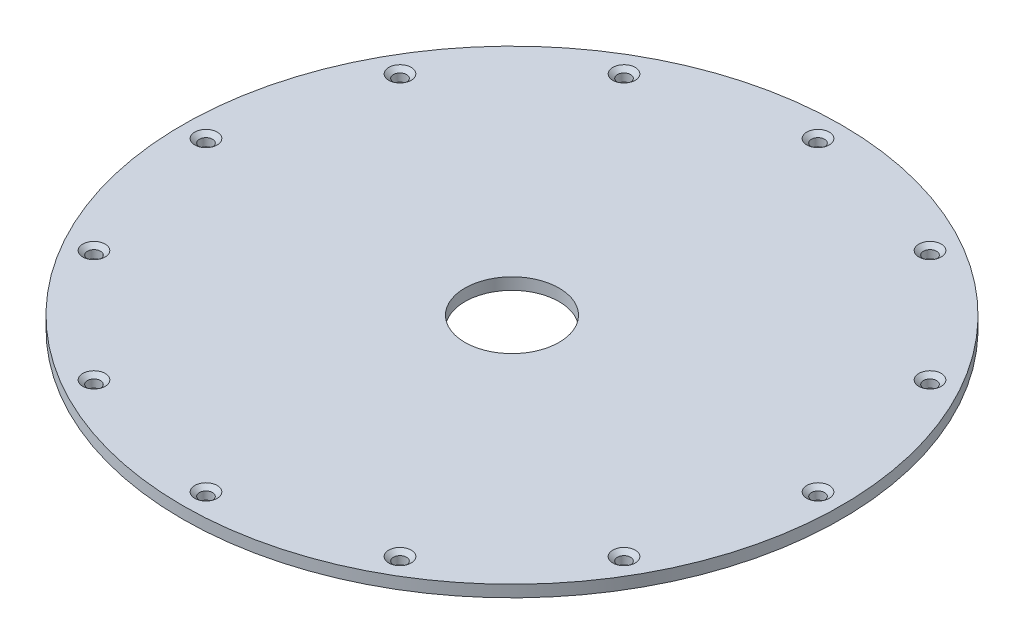
ISO-10303-21;
HEADER;
FILE_DESCRIPTION(('STEP AP214'),'2;1');
FILE_NAME('part.step','',(''),(''),'','','');
FILE_SCHEMA(('AUTOMOTIVE_DESIGN { 1 0 10303 214 1 1 1 1 }'));
ENDSEC;
DATA;
#1=APPLICATION_CONTEXT('core data for automotive mechanical design processes');
#2=APPLICATION_PROTOCOL_DEFINITION('international standard','automotive_design',2000,#1);
#3=PRODUCT_CONTEXT('',#1,'mechanical');
#4=PRODUCT('Part','Part','',(#3));
#5=PRODUCT_RELATED_PRODUCT_CATEGORY('part','',(#4));
#6=PRODUCT_DEFINITION_FORMATION('','',#4);
#7=PRODUCT_DEFINITION_CONTEXT('part definition',#1,'design');
#8=PRODUCT_DEFINITION('design','',#6,#7);
#9=PRODUCT_DEFINITION_SHAPE('','',#8);
#10=(LENGTH_UNIT() NAMED_UNIT(*) SI_UNIT(.MILLI.,.METRE.));
#11=(NAMED_UNIT(*) PLANE_ANGLE_UNIT() SI_UNIT($,.RADIAN.));
#12=(NAMED_UNIT(*) SI_UNIT($,.STERADIAN.) SOLID_ANGLE_UNIT());
#13=UNCERTAINTY_MEASURE_WITH_UNIT(LENGTH_MEASURE(1.E-05),#10,'distance_accuracy_value','');
#14=(GEOMETRIC_REPRESENTATION_CONTEXT(3) GLOBAL_UNCERTAINTY_ASSIGNED_CONTEXT((#13)) GLOBAL_UNIT_ASSIGNED_CONTEXT((#10,
#11,#12)) REPRESENTATION_CONTEXT('',''));
#15=CARTESIAN_POINT('',(0.,0.,0.));
#16=DIRECTION('',(0.,0.,1.));
#17=DIRECTION('',(1.,0.,0.));
#18=AXIS2_PLACEMENT_3D('',#15,#16,#17);
#19=CARTESIAN_POINT('',(0.,55.,0.));
#20=DIRECTION('',(0.,1.,0.));
#21=DIRECTION('',(0.,0.,1.));
#22=AXIS2_PLACEMENT_3D('',#19,#20,#21);
#23=CYLINDRICAL_SURFACE('',#22,44.45);
#24=CARTESIAN_POINT('',(0.,0.,0.));
#25=DIRECTION('',(0.,1.,0.));
#26=DIRECTION('',(0.,0.,1.));
#27=AXIS2_PLACEMENT_3D('',#24,#25,#26);
#28=CIRCLE('',#27,44.45);
#29=CARTESIAN_POINT('',(0.,0.,44.45));
#30=VERTEX_POINT('',#29);
#31=EDGE_CURVE('E45',#30,#30,#28,.T.);
#32=ORIENTED_EDGE('',*,*,#31,.T.);
#33=EDGE_LOOP('',(#32));
#34=FACE_BOUND('',#33,.T.);
#35=CARTESIAN_POINT('',(0.,1.5875,0.));
#36=DIRECTION('',(0.,1.,0.));
#37=DIRECTION('',(0.,0.,1.));
#38=AXIS2_PLACEMENT_3D('',#35,#36,#37);
#39=CIRCLE('',#38,44.45);
#40=CARTESIAN_POINT('',(0.,1.5875,44.45));
#41=VERTEX_POINT('',#40);
#42=EDGE_CURVE('E10',#41,#41,#39,.T.);
#43=ORIENTED_EDGE('',*,*,#42,.F.);
#44=EDGE_LOOP('',(#43));
#45=FACE_BOUND('',#44,.T.);
#46=ADVANCED_FACE('F31',(#34,#45),#23,.T.);
#47=CARTESIAN_POINT('',(-44.45,1.5875,0.));
#48=DIRECTION('',(0.,1.,0.));
#49=DIRECTION('',(0.,0.,1.));
#50=AXIS2_PLACEMENT_3D('',#47,#48,#49);
#51=PLANE('',#50);
#52=CARTESIAN_POINT('',(-35.7451985412029,1.5875,20.6374999999996));
#53=DIRECTION('',(0.,1.,0.));
#54=DIRECTION('',(0.,0.,1.));
#55=AXIS2_PLACEMENT_3D('',#52,#53,#54);
#56=CIRCLE('',#55,1.5113);
#57=CARTESIAN_POINT('',(-35.7451985412029,1.5875,22.1487999999996));
#58=VERTEX_POINT('',#57);
#59=EDGE_CURVE('E155',#58,#58,#56,.T.);
#60=ORIENTED_EDGE('',*,*,#59,.F.);
#61=EDGE_LOOP('',(#60));
#62=FACE_BOUND('',#61,.T.);
#63=CARTESIAN_POINT('',(-20.6375000000004,1.5875,35.7451985412025));
#64=DIRECTION('',(0.,1.,0.));
#65=DIRECTION('',(0.,0.,1.));
#66=AXIS2_PLACEMENT_3D('',#63,#64,#65);
#67=CIRCLE('',#66,1.5113);
#68=CARTESIAN_POINT('',(-20.6375000000004,1.5875,37.2564985412025));
#69=VERTEX_POINT('',#68);
#70=EDGE_CURVE('E146',#69,#69,#67,.T.);
#71=ORIENTED_EDGE('',*,*,#70,.F.);
#72=EDGE_LOOP('',(#71));
#73=FACE_BOUND('',#72,.T.);
#74=CARTESIAN_POINT('',(-3.53958818572525E-13,1.5875,41.275));
#75=DIRECTION('',(0.,1.,0.));
#76=DIRECTION('',(0.,0.,1.));
#77=AXIS2_PLACEMENT_3D('',#74,#75,#76);
#78=CIRCLE('',#77,1.5113);
#79=CARTESIAN_POINT('',(-3.53958818572525E-13,1.5875,42.7863));
#80=VERTEX_POINT('',#79);
#81=EDGE_CURVE('E137',#80,#80,#78,.T.);
#82=ORIENTED_EDGE('',*,*,#81,.F.);
#83=EDGE_LOOP('',(#82));
#84=FACE_BOUND('',#83,.T.);
#85=CARTESIAN_POINT('',(20.6374999999997,1.5875,35.7451985412029));
#86=DIRECTION('',(0.,1.,0.));
#87=DIRECTION('',(0.,0.,1.));
#88=AXIS2_PLACEMENT_3D('',#85,#86,#87);
#89=CIRCLE('',#88,1.5113);
#90=CARTESIAN_POINT('',(20.6374999999997,1.5875,37.2564985412029));
#91=VERTEX_POINT('',#90);
#92=EDGE_CURVE('E128',#91,#91,#89,.T.);
#93=ORIENTED_EDGE('',*,*,#92,.F.);
#94=EDGE_LOOP('',(#93));
#95=FACE_BOUND('',#94,.T.);
#96=CARTESIAN_POINT('',(35.7451985412026,1.5875,20.6375000000002));
#97=DIRECTION('',(0.,1.,0.));
#98=DIRECTION('',(0.,0.,1.));
#99=AXIS2_PLACEMENT_3D('',#96,#97,#98);
#100=CIRCLE('',#99,1.5113);
#101=CARTESIAN_POINT('',(35.7451985412026,1.5875,22.1488000000002));
#102=VERTEX_POINT('',#101);
#103=EDGE_CURVE('E119',#102,#102,#100,.T.);
#104=ORIENTED_EDGE('',*,*,#103,.F.);
#105=EDGE_LOOP('',(#104));
#106=FACE_BOUND('',#105,.T.);
#107=CARTESIAN_POINT('',(41.275,1.5875,2.28177708448336E-13));
#108=DIRECTION('',(0.,1.,0.));
#109=DIRECTION('',(0.,0.,1.));
#110=AXIS2_PLACEMENT_3D('',#107,#108,#109);
#111=CIRCLE('',#110,1.5113);
#112=CARTESIAN_POINT('',(41.275,1.5875,1.51130000000023));
#113=VERTEX_POINT('',#112);
#114=EDGE_CURVE('E110',#113,#113,#111,.T.);
#115=ORIENTED_EDGE('',*,*,#114,.F.);
#116=EDGE_LOOP('',(#115));
#117=FACE_BOUND('',#116,.T.);
#118=CARTESIAN_POINT('',(35.7451985412028,1.5875,-20.6374999999998));
#119=DIRECTION('',(0.,1.,0.));
#120=DIRECTION('',(0.,0.,1.));
#121=AXIS2_PLACEMENT_3D('',#118,#119,#120);
#122=CIRCLE('',#121,1.5113);
#123=CARTESIAN_POINT('',(35.7451985412028,1.5875,-19.1261999999998));
#124=VERTEX_POINT('',#123);
#125=EDGE_CURVE('E101',#124,#124,#122,.T.);
#126=ORIENTED_EDGE('',*,*,#125,.F.);
#127=EDGE_LOOP('',(#126));
#128=FACE_BOUND('',#127,.T.);
#129=CARTESIAN_POINT('',(20.6375000000001,1.5875,-35.7451985412026));
#130=DIRECTION('',(0.,1.,0.));
#131=DIRECTION('',(0.,0.,1.));
#132=AXIS2_PLACEMENT_3D('',#129,#130,#131);
#133=CIRCLE('',#132,1.5113);
#134=CARTESIAN_POINT('',(20.6375000000001,1.5875,-34.2338985412026));
#135=VERTEX_POINT('',#134);
#136=EDGE_CURVE('E92',#135,#135,#133,.T.);
#137=ORIENTED_EDGE('',*,*,#136,.F.);
#138=EDGE_LOOP('',(#137));
#139=FACE_BOUND('',#138,.T.);
#140=CARTESIAN_POINT('',(1.11561489392428E-13,1.5875,-41.275));
#141=DIRECTION('',(0.,1.,0.));
#142=DIRECTION('',(0.,0.,1.));
#143=AXIS2_PLACEMENT_3D('',#140,#141,#142);
#144=CIRCLE('',#143,1.5113);
#145=CARTESIAN_POINT('',(1.11561489392428E-13,1.5875,-39.7637));
#146=VERTEX_POINT('',#145);
#147=EDGE_CURVE('E83',#146,#146,#144,.T.);
#148=ORIENTED_EDGE('',*,*,#147,.F.);
#149=EDGE_LOOP('',(#148));
#150=FACE_BOUND('',#149,.T.);
#151=CARTESIAN_POINT('',(-20.6374999999999,1.5875,-35.7451985412027));
#152=DIRECTION('',(0.,1.,0.));
#153=DIRECTION('',(0.,0.,1.));
#154=AXIS2_PLACEMENT_3D('',#151,#152,#153);
#155=CIRCLE('',#154,1.5113);
#156=CARTESIAN_POINT('',(-20.6374999999999,1.5875,-34.2338985412027));
#157=VERTEX_POINT('',#156);
#158=EDGE_CURVE('E74',#157,#157,#155,.T.);
#159=ORIENTED_EDGE('',*,*,#158,.F.);
#160=EDGE_LOOP('',(#159));
#161=FACE_BOUND('',#160,.T.);
#162=CARTESIAN_POINT('',(-35.7451985412027,1.5875,-20.6375));
#163=DIRECTION('',(0.,1.,0.));
#164=DIRECTION('',(0.,0.,1.));
#165=AXIS2_PLACEMENT_3D('',#162,#163,#164);
#166=CIRCLE('',#165,1.5113);
#167=CARTESIAN_POINT('',(-35.7451985412027,1.5875,-19.1262));
#168=VERTEX_POINT('',#167);
#169=EDGE_CURVE('E65',#168,#168,#166,.T.);
#170=ORIENTED_EDGE('',*,*,#169,.F.);
#171=EDGE_LOOP('',(#170));
#172=FACE_BOUND('',#171,.T.);
#173=CARTESIAN_POINT('',(-41.275,1.5875,0.));
#174=DIRECTION('',(0.,1.,0.));
#175=DIRECTION('',(0.,0.,1.));
#176=AXIS2_PLACEMENT_3D('',#173,#174,#175);
#177=CIRCLE('',#176,1.5113);
#178=CARTESIAN_POINT('',(-41.275,1.5875,1.51130000000001));
#179=VERTEX_POINT('',#178);
#180=EDGE_CURVE('E56',#179,#179,#177,.T.);
#181=ORIENTED_EDGE('',*,*,#180,.F.);
#182=EDGE_LOOP('',(#181));
#183=FACE_BOUND('',#182,.T.);
#184=ORIENTED_EDGE('',*,*,#42,.T.);
#185=EDGE_LOOP('',(#184));
#186=FACE_BOUND('',#185,.T.);
#187=CARTESIAN_POINT('',(0.,1.5875,0.));
#188=DIRECTION('',(0.,1.,0.));
#189=DIRECTION('',(0.,0.,1.));
#190=AXIS2_PLACEMENT_3D('',#187,#188,#189);
#191=CIRCLE('',#190,6.35);
#192=CARTESIAN_POINT('',(0.,1.5875,6.35));
#193=VERTEX_POINT('',#192);
#194=EDGE_CURVE('E37',#193,#193,#191,.T.);
#195=ORIENTED_EDGE('',*,*,#194,.F.);
#196=EDGE_LOOP('',(#195));
#197=FACE_BOUND('',#196,.T.);
#198=ADVANCED_FACE('F161',(#62,#73,#84,#95,#106,#117,#128,#139,#150,#161,#172,#183,#186,#197),
#51,.T.);
#199=CARTESIAN_POINT('',(0.,55.,0.));
#200=DIRECTION('',(0.,1.,0.));
#201=DIRECTION('',(0.,0.,1.));
#202=AXIS2_PLACEMENT_3D('',#199,#200,#201);
#203=CYLINDRICAL_SURFACE('',#202,6.35);
#204=ORIENTED_EDGE('',*,*,#194,.T.);
#205=EDGE_LOOP('',(#204));
#206=FACE_BOUND('',#205,.T.);
#207=CARTESIAN_POINT('',(0.,0.,0.));
#208=DIRECTION('',(0.,1.,0.));
#209=DIRECTION('',(0.,0.,1.));
#210=AXIS2_PLACEMENT_3D('',#207,#208,#209);
#211=CIRCLE('',#210,6.35);
#212=CARTESIAN_POINT('',(0.,0.,6.35));
#213=VERTEX_POINT('',#212);
#214=EDGE_CURVE('E41',#213,#213,#211,.T.);
#215=ORIENTED_EDGE('',*,*,#214,.F.);
#216=EDGE_LOOP('',(#215));
#217=FACE_BOUND('',#216,.T.);
#218=ADVANCED_FACE('F164',(#206,#217),#203,.F.);
#219=CARTESIAN_POINT('',(-44.45,0.,0.));
#220=DIRECTION('',(0.,-1.,0.));
#221=DIRECTION('',(0.,0.,-1.));
#222=AXIS2_PLACEMENT_3D('',#219,#220,#221);
#223=PLANE('',#222);
#224=CARTESIAN_POINT('',(-35.7451985412029,0.,20.6374999999996));
#225=DIRECTION('',(0.,1.,0.));
#226=DIRECTION('',(0.,0.,1.));
#227=AXIS2_PLACEMENT_3D('',#224,#225,#226);
#228=CIRCLE('',#227,0.889000000000001);
#229=CARTESIAN_POINT('',(-35.7451985412029,0.,21.5264999999996));
#230=VERTEX_POINT('',#229);
#231=EDGE_CURVE('E149',#230,#230,#228,.T.);
#232=ORIENTED_EDGE('',*,*,#231,.T.);
#233=EDGE_LOOP('',(#232));
#234=FACE_BOUND('',#233,.T.);
#235=CARTESIAN_POINT('',(-20.6375000000004,0.,35.7451985412025));
#236=DIRECTION('',(0.,1.,0.));
#237=DIRECTION('',(0.,0.,1.));
#238=AXIS2_PLACEMENT_3D('',#235,#236,#237);
#239=CIRCLE('',#238,0.888999999999997);
#240=CARTESIAN_POINT('',(-20.6375000000004,0.,36.6341985412025));
#241=VERTEX_POINT('',#240);
#242=EDGE_CURVE('E140',#241,#241,#239,.T.);
#243=ORIENTED_EDGE('',*,*,#242,.T.);
#244=EDGE_LOOP('',(#243));
#245=FACE_BOUND('',#244,.T.);
#246=CARTESIAN_POINT('',(-3.53958818572525E-13,0.,41.275));
#247=DIRECTION('',(0.,1.,0.));
#248=DIRECTION('',(0.,0.,1.));
#249=AXIS2_PLACEMENT_3D('',#246,#247,#248);
#250=CIRCLE('',#249,0.888999999999999);
#251=CARTESIAN_POINT('',(-3.53958818572525E-13,0.,42.164));
#252=VERTEX_POINT('',#251);
#253=EDGE_CURVE('E131',#252,#252,#250,.T.);
#254=ORIENTED_EDGE('',*,*,#253,.T.);
#255=EDGE_LOOP('',(#254));
#256=FACE_BOUND('',#255,.T.);
#257=CARTESIAN_POINT('',(20.6374999999997,0.,35.7451985412029));
#258=DIRECTION('',(0.,1.,0.));
#259=DIRECTION('',(0.,0.,1.));
#260=AXIS2_PLACEMENT_3D('',#257,#258,#259);
#261=CIRCLE('',#260,0.888999999999997);
#262=CARTESIAN_POINT('',(20.6374999999997,0.,36.6341985412029));
#263=VERTEX_POINT('',#262);
#264=EDGE_CURVE('E122',#263,#263,#261,.T.);
#265=ORIENTED_EDGE('',*,*,#264,.T.);
#266=EDGE_LOOP('',(#265));
#267=FACE_BOUND('',#266,.T.);
#268=CARTESIAN_POINT('',(35.7451985412026,0.,20.6375000000002));
#269=DIRECTION('',(0.,1.,0.));
#270=DIRECTION('',(0.,0.,1.));
#271=AXIS2_PLACEMENT_3D('',#268,#269,#270);
#272=CIRCLE('',#271,0.889000000000001);
#273=CARTESIAN_POINT('',(35.7451985412026,0.,21.5265000000002));
#274=VERTEX_POINT('',#273);
#275=EDGE_CURVE('E113',#274,#274,#272,.T.);
#276=ORIENTED_EDGE('',*,*,#275,.T.);
#277=EDGE_LOOP('',(#276));
#278=FACE_BOUND('',#277,.T.);
#279=CARTESIAN_POINT('',(41.275,0.,2.28177708448336E-13));
#280=DIRECTION('',(0.,1.,0.));
#281=DIRECTION('',(0.,0.,1.));
#282=AXIS2_PLACEMENT_3D('',#279,#280,#281);
#283=CIRCLE('',#282,0.889000000000001);
#284=CARTESIAN_POINT('',(41.275,0.,0.889000000000229));
#285=VERTEX_POINT('',#284);
#286=EDGE_CURVE('E104',#285,#285,#283,.T.);
#287=ORIENTED_EDGE('',*,*,#286,.T.);
#288=EDGE_LOOP('',(#287));
#289=FACE_BOUND('',#288,.T.);
#290=CARTESIAN_POINT('',(35.7451985412028,0.,-20.6374999999998));
#291=DIRECTION('',(0.,1.,0.));
#292=DIRECTION('',(0.,0.,1.));
#293=AXIS2_PLACEMENT_3D('',#290,#291,#292);
#294=CIRCLE('',#293,0.889000000000001);
#295=CARTESIAN_POINT('',(35.7451985412028,0.,-19.7484999999998));
#296=VERTEX_POINT('',#295);
#297=EDGE_CURVE('E95',#296,#296,#294,.T.);
#298=ORIENTED_EDGE('',*,*,#297,.T.);
#299=EDGE_LOOP('',(#298));
#300=FACE_BOUND('',#299,.T.);
#301=CARTESIAN_POINT('',(20.6375000000001,0.,-35.7451985412026));
#302=DIRECTION('',(0.,1.,0.));
#303=DIRECTION('',(0.,0.,1.));
#304=AXIS2_PLACEMENT_3D('',#301,#302,#303);
#305=CIRCLE('',#304,0.888999999999997);
#306=CARTESIAN_POINT('',(20.6375000000001,0.,-34.8561985412026));
#307=VERTEX_POINT('',#306);
#308=EDGE_CURVE('E86',#307,#307,#305,.T.);
#309=ORIENTED_EDGE('',*,*,#308,.T.);
#310=EDGE_LOOP('',(#309));
#311=FACE_BOUND('',#310,.T.);
#312=CARTESIAN_POINT('',(1.11561489392428E-13,0.,-41.275));
#313=DIRECTION('',(0.,1.,0.));
#314=DIRECTION('',(0.,0.,1.));
#315=AXIS2_PLACEMENT_3D('',#312,#313,#314);
#316=CIRCLE('',#315,0.888999999999999);
#317=CARTESIAN_POINT('',(1.11561489392428E-13,0.,-40.386));
#318=VERTEX_POINT('',#317);
#319=EDGE_CURVE('E77',#318,#318,#316,.T.);
#320=ORIENTED_EDGE('',*,*,#319,.T.);
#321=EDGE_LOOP('',(#320));
#322=FACE_BOUND('',#321,.T.);
#323=CARTESIAN_POINT('',(-20.6374999999999,0.,-35.7451985412027));
#324=DIRECTION('',(0.,1.,0.));
#325=DIRECTION('',(0.,0.,1.));
#326=AXIS2_PLACEMENT_3D('',#323,#324,#325);
#327=CIRCLE('',#326,0.888999999999997);
#328=CARTESIAN_POINT('',(-20.6374999999999,0.,-34.8561985412027));
#329=VERTEX_POINT('',#328);
#330=EDGE_CURVE('E68',#329,#329,#327,.T.);
#331=ORIENTED_EDGE('',*,*,#330,.T.);
#332=EDGE_LOOP('',(#331));
#333=FACE_BOUND('',#332,.T.);
#334=CARTESIAN_POINT('',(-35.7451985412027,0.,-20.6375));
#335=DIRECTION('',(0.,1.,0.));
#336=DIRECTION('',(0.,0.,1.));
#337=AXIS2_PLACEMENT_3D('',#334,#335,#336);
#338=CIRCLE('',#337,0.889000000000001);
#339=CARTESIAN_POINT('',(-35.7451985412027,0.,-19.7485));
#340=VERTEX_POINT('',#339);
#341=EDGE_CURVE('E59',#340,#340,#338,.T.);
#342=ORIENTED_EDGE('',*,*,#341,.T.);
#343=EDGE_LOOP('',(#342));
#344=FACE_BOUND('',#343,.T.);
#345=CARTESIAN_POINT('',(-41.275,0.,0.));
#346=DIRECTION('',(0.,1.,0.));
#347=DIRECTION('',(0.,0.,1.));
#348=AXIS2_PLACEMENT_3D('',#345,#346,#347);
#349=CIRCLE('',#348,0.889000000000001);
#350=CARTESIAN_POINT('',(-41.275,0.,0.889000000000006));
#351=VERTEX_POINT('',#350);
#352=EDGE_CURVE('E50',#351,#351,#349,.T.);
#353=ORIENTED_EDGE('',*,*,#352,.T.);
#354=EDGE_LOOP('',(#353));
#355=FACE_BOUND('',#354,.T.);
#356=ORIENTED_EDGE('',*,*,#214,.T.);
#357=EDGE_LOOP('',(#356));
#358=FACE_BOUND('',#357,.T.);
#359=ORIENTED_EDGE('',*,*,#31,.F.);
#360=EDGE_LOOP('',(#359));
#361=FACE_BOUND('',#360,.T.);
#362=ADVANCED_FACE('F201',(#234,#245,#256,#267,#278,#289,#300,#311,#322,#333,#344,#355,#358,
#361),#223,.T.);
#363=CARTESIAN_POINT('',(-41.275,1.5875,0.));
#364=DIRECTION('',(0.,1.,0.));
#365=DIRECTION('',(0.,0.,1.));
#366=AXIS2_PLACEMENT_3D('',#363,#364,#365);
#367=CYLINDRICAL_SURFACE('',#366,0.889000000000001);
#368=ORIENTED_EDGE('',*,*,#352,.F.);
#369=EDGE_LOOP('',(#368));
#370=FACE_BOUND('',#369,.T.);
#371=CARTESIAN_POINT('',(-41.275,1.06532829951838,0.));
#372=DIRECTION('',(0.,1.,0.));
#373=DIRECTION('',(0.,0.,1.));
#374=AXIS2_PLACEMENT_3D('',#371,#372,#373);
#375=CIRCLE('',#374,0.889000000000001);
#376=CARTESIAN_POINT('',(-41.275,1.06532829951838,0.889000000000006));
#377=VERTEX_POINT('',#376);
#378=EDGE_CURVE('E53',#377,#377,#375,.T.);
#379=ORIENTED_EDGE('',*,*,#378,.T.);
#380=EDGE_LOOP('',(#379));
#381=FACE_BOUND('',#380,.T.);
#382=ADVANCED_FACE('F191',(#370,#381),#367,.F.);
#383=CARTESIAN_POINT('',(-41.275,1.5875,0.));
#384=DIRECTION('',(0.,1.,0.));
#385=DIRECTION('',(0.,0.,1.));
#386=AXIS2_PLACEMENT_3D('',#383,#384,#385);
#387=CONICAL_SURFACE('',#386,1.5113,0.872664625997162);
#388=ORIENTED_EDGE('',*,*,#378,.F.);
#389=EDGE_LOOP('',(#388));
#390=FACE_BOUND('',#389,.T.);
#391=ORIENTED_EDGE('',*,*,#180,.T.);
#392=EDGE_LOOP('',(#391));
#393=FACE_BOUND('',#392,.T.);
#394=ADVANCED_FACE('F188',(#390,#393),#387,.F.);
#395=CARTESIAN_POINT('',(-35.7451985412027,1.5875,-20.6375));
#396=DIRECTION('',(0.,1.,0.));
#397=DIRECTION('',(0.,0.,1.));
#398=AXIS2_PLACEMENT_3D('',#395,#396,#397);
#399=CYLINDRICAL_SURFACE('',#398,0.889000000000001);
#400=ORIENTED_EDGE('',*,*,#341,.F.);
#401=EDGE_LOOP('',(#400));
#402=FACE_BOUND('',#401,.T.);
#403=CARTESIAN_POINT('',(-35.7451985412027,1.06532829951838,-20.6375));
#404=DIRECTION('',(0.,1.,0.));
#405=DIRECTION('',(0.,0.,1.));
#406=AXIS2_PLACEMENT_3D('',#403,#404,#405);
#407=CIRCLE('',#406,0.889000000000001);
#408=CARTESIAN_POINT('',(-35.7451985412027,1.06532829951838,-19.7485));
#409=VERTEX_POINT('',#408);
#410=EDGE_CURVE('E62',#409,#409,#407,.T.);
#411=ORIENTED_EDGE('',*,*,#410,.T.);
#412=EDGE_LOOP('',(#411));
#413=FACE_BOUND('',#412,.T.);
#414=ADVANCED_FACE('F190',(#402,#413),#399,.F.);
#415=CARTESIAN_POINT('',(-35.7451985412027,1.5875,-20.6375));
#416=DIRECTION('',(0.,1.,0.));
#417=DIRECTION('',(0.,0.,1.));
#418=AXIS2_PLACEMENT_3D('',#415,#416,#417);
#419=CONICAL_SURFACE('',#418,1.5113,0.872664625997162);
#420=ORIENTED_EDGE('',*,*,#410,.F.);
#421=EDGE_LOOP('',(#420));
#422=FACE_BOUND('',#421,.T.);
#423=ORIENTED_EDGE('',*,*,#169,.T.);
#424=EDGE_LOOP('',(#423));
#425=FACE_BOUND('',#424,.T.);
#426=ADVANCED_FACE('F198',(#422,#425),#419,.F.);
#427=CARTESIAN_POINT('',(-20.6374999999999,1.5875,-35.7451985412027));
#428=DIRECTION('',(0.,1.,0.));
#429=DIRECTION('',(0.,0.,1.));
#430=AXIS2_PLACEMENT_3D('',#427,#428,#429);
#431=CYLINDRICAL_SURFACE('',#430,0.888999999999999);
#432=ORIENTED_EDGE('',*,*,#330,.F.);
#433=EDGE_LOOP('',(#432));
#434=FACE_BOUND('',#433,.T.);
#435=CARTESIAN_POINT('',(-20.6374999999999,1.06532829951838,-35.7451985412027));
#436=DIRECTION('',(0.,1.,0.));
#437=DIRECTION('',(0.,0.,1.));
#438=AXIS2_PLACEMENT_3D('',#435,#436,#437);
#439=CIRCLE('',#438,0.889000000000001);
#440=CARTESIAN_POINT('',(-20.6374999999999,1.06532829951838,-34.8561985412027));
#441=VERTEX_POINT('',#440);
#442=EDGE_CURVE('E71',#441,#441,#439,.T.);
#443=ORIENTED_EDGE('',*,*,#442,.T.);
#444=EDGE_LOOP('',(#443));
#445=FACE_BOUND('',#444,.T.);
#446=ADVANCED_FACE('F251',(#434,#445),#431,.F.);
#447=CARTESIAN_POINT('',(-20.6374999999999,1.5875,-35.7451985412027));
#448=DIRECTION('',(0.,1.,0.));
#449=DIRECTION('',(0.,0.,1.));
#450=AXIS2_PLACEMENT_3D('',#447,#448,#449);
#451=CONICAL_SURFACE('',#450,1.5113,0.872664625997162);
#452=ORIENTED_EDGE('',*,*,#442,.F.);
#453=EDGE_LOOP('',(#452));
#454=FACE_BOUND('',#453,.T.);
#455=ORIENTED_EDGE('',*,*,#158,.T.);
#456=EDGE_LOOP('',(#455));
#457=FACE_BOUND('',#456,.T.);
#458=ADVANCED_FACE('F256',(#454,#457),#451,.F.);
#459=CARTESIAN_POINT('',(1.11561489392428E-13,1.5875,-41.275));
#460=DIRECTION('',(0.,1.,0.));
#461=DIRECTION('',(0.,0.,1.));
#462=AXIS2_PLACEMENT_3D('',#459,#460,#461);
#463=CYLINDRICAL_SURFACE('',#462,0.888999999999999);
#464=ORIENTED_EDGE('',*,*,#319,.F.);
#465=EDGE_LOOP('',(#464));
#466=FACE_BOUND('',#465,.T.);
#467=CARTESIAN_POINT('',(1.11561489392428E-13,1.06532829951838,-41.275));
#468=DIRECTION('',(0.,1.,0.));
#469=DIRECTION('',(0.,0.,1.));
#470=AXIS2_PLACEMENT_3D('',#467,#468,#469);
#471=CIRCLE('',#470,0.888999999999999);
#472=CARTESIAN_POINT('',(1.11561489392428E-13,1.06532829951838,-40.386));
#473=VERTEX_POINT('',#472);
#474=EDGE_CURVE('E80',#473,#473,#471,.T.);
#475=ORIENTED_EDGE('',*,*,#474,.T.);
#476=EDGE_LOOP('',(#475));
#477=FACE_BOUND('',#476,.T.);
#478=ADVANCED_FACE('F262',(#466,#477),#463,.F.);
#479=CARTESIAN_POINT('',(1.11561489392428E-13,1.5875,-41.275));
#480=DIRECTION('',(0.,1.,0.));
#481=DIRECTION('',(0.,0.,1.));
#482=AXIS2_PLACEMENT_3D('',#479,#480,#481);
#483=CONICAL_SURFACE('',#482,1.5113,0.872664625997163);
#484=ORIENTED_EDGE('',*,*,#474,.F.);
#485=EDGE_LOOP('',(#484));
#486=FACE_BOUND('',#485,.T.);
#487=ORIENTED_EDGE('',*,*,#147,.T.);
#488=EDGE_LOOP('',(#487));
#489=FACE_BOUND('',#488,.T.);
#490=ADVANCED_FACE('F266',(#486,#489),#483,.F.);
#491=CARTESIAN_POINT('',(20.6375000000001,1.5875,-35.7451985412026));
#492=DIRECTION('',(0.,1.,0.));
#493=DIRECTION('',(0.,0.,1.));
#494=AXIS2_PLACEMENT_3D('',#491,#492,#493);
#495=CYLINDRICAL_SURFACE('',#494,0.888999999999999);
#496=ORIENTED_EDGE('',*,*,#308,.F.);
#497=EDGE_LOOP('',(#496));
#498=FACE_BOUND('',#497,.T.);
#499=CARTESIAN_POINT('',(20.6375000000001,1.06532829951838,-35.7451985412026));
#500=DIRECTION('',(0.,1.,0.));
#501=DIRECTION('',(0.,0.,1.));
#502=AXIS2_PLACEMENT_3D('',#499,#500,#501);
#503=CIRCLE('',#502,0.889000000000001);
#504=CARTESIAN_POINT('',(20.6375000000001,1.06532829951838,-34.8561985412026));
#505=VERTEX_POINT('',#504);
#506=EDGE_CURVE('E89',#505,#505,#503,.T.);
#507=ORIENTED_EDGE('',*,*,#506,.T.);
#508=EDGE_LOOP('',(#507));
#509=FACE_BOUND('',#508,.T.);
#510=ADVANCED_FACE('F270',(#498,#509),#495,.F.);
#511=CARTESIAN_POINT('',(20.6375000000001,1.5875,-35.7451985412026));
#512=DIRECTION('',(0.,1.,0.));
#513=DIRECTION('',(0.,0.,1.));
#514=AXIS2_PLACEMENT_3D('',#511,#512,#513);
#515=CONICAL_SURFACE('',#514,1.5113,0.872664625997162);
#516=ORIENTED_EDGE('',*,*,#506,.F.);
#517=EDGE_LOOP('',(#516));
#518=FACE_BOUND('',#517,.T.);
#519=ORIENTED_EDGE('',*,*,#136,.T.);
#520=EDGE_LOOP('',(#519));
#521=FACE_BOUND('',#520,.T.);
#522=ADVANCED_FACE('F274',(#518,#521),#515,.F.);
#523=CARTESIAN_POINT('',(35.7451985412028,1.5875,-20.6374999999998));
#524=DIRECTION('',(0.,1.,0.));
#525=DIRECTION('',(0.,0.,1.));
#526=AXIS2_PLACEMENT_3D('',#523,#524,#525);
#527=CYLINDRICAL_SURFACE('',#526,0.889000000000001);
#528=ORIENTED_EDGE('',*,*,#297,.F.);
#529=EDGE_LOOP('',(#528));
#530=FACE_BOUND('',#529,.T.);
#531=CARTESIAN_POINT('',(35.7451985412028,1.06532829951838,-20.6374999999998));
#532=DIRECTION('',(0.,1.,0.));
#533=DIRECTION('',(0.,0.,1.));
#534=AXIS2_PLACEMENT_3D('',#531,#532,#533);
#535=CIRCLE('',#534,0.889000000000001);
#536=CARTESIAN_POINT('',(35.7451985412028,1.06532829951838,-19.7484999999998));
#537=VERTEX_POINT('',#536);
#538=EDGE_CURVE('E98',#537,#537,#535,.T.);
#539=ORIENTED_EDGE('',*,*,#538,.T.);
#540=EDGE_LOOP('',(#539));
#541=FACE_BOUND('',#540,.T.);
#542=ADVANCED_FACE('F278',(#530,#541),#527,.F.);
#543=CARTESIAN_POINT('',(35.7451985412028,1.5875,-20.6374999999998));
#544=DIRECTION('',(0.,1.,0.));
#545=DIRECTION('',(0.,0.,1.));
#546=AXIS2_PLACEMENT_3D('',#543,#544,#545);
#547=CONICAL_SURFACE('',#546,1.5113,0.872664625997162);
#548=ORIENTED_EDGE('',*,*,#538,.F.);
#549=EDGE_LOOP('',(#548));
#550=FACE_BOUND('',#549,.T.);
#551=ORIENTED_EDGE('',*,*,#125,.T.);
#552=EDGE_LOOP('',(#551));
#553=FACE_BOUND('',#552,.T.);
#554=ADVANCED_FACE('F282',(#550,#553),#547,.F.);
#555=CARTESIAN_POINT('',(41.275,1.5875,2.28177708448336E-13));
#556=DIRECTION('',(0.,1.,0.));
#557=DIRECTION('',(0.,0.,1.));
#558=AXIS2_PLACEMENT_3D('',#555,#556,#557);
#559=CYLINDRICAL_SURFACE('',#558,0.889000000000001);
#560=ORIENTED_EDGE('',*,*,#286,.F.);
#561=EDGE_LOOP('',(#560));
#562=FACE_BOUND('',#561,.T.);
#563=CARTESIAN_POINT('',(41.275,1.06532829951838,2.28177708448336E-13));
#564=DIRECTION('',(0.,1.,0.));
#565=DIRECTION('',(0.,0.,1.));
#566=AXIS2_PLACEMENT_3D('',#563,#564,#565);
#567=CIRCLE('',#566,0.889000000000001);
#568=CARTESIAN_POINT('',(41.275,1.06532829951838,0.889000000000229));
#569=VERTEX_POINT('',#568);
#570=EDGE_CURVE('E107',#569,#569,#567,.T.);
#571=ORIENTED_EDGE('',*,*,#570,.T.);
#572=EDGE_LOOP('',(#571));
#573=FACE_BOUND('',#572,.T.);
#574=ADVANCED_FACE('F286',(#562,#573),#559,.F.);
#575=CARTESIAN_POINT('',(41.275,1.5875,2.28177708448336E-13));
#576=DIRECTION('',(0.,1.,0.));
#577=DIRECTION('',(0.,0.,1.));
#578=AXIS2_PLACEMENT_3D('',#575,#576,#577);
#579=CONICAL_SURFACE('',#578,1.5113,0.872664625997162);
#580=ORIENTED_EDGE('',*,*,#570,.F.);
#581=EDGE_LOOP('',(#580));
#582=FACE_BOUND('',#581,.T.);
#583=ORIENTED_EDGE('',*,*,#114,.T.);
#584=EDGE_LOOP('',(#583));
#585=FACE_BOUND('',#584,.T.);
#586=ADVANCED_FACE('F290',(#582,#585),#579,.F.);
#587=CARTESIAN_POINT('',(35.7451985412026,1.5875,20.6375000000002));
#588=DIRECTION('',(0.,1.,0.));
#589=DIRECTION('',(0.,0.,1.));
#590=AXIS2_PLACEMENT_3D('',#587,#588,#589);
#591=CYLINDRICAL_SURFACE('',#590,0.889000000000001);
#592=ORIENTED_EDGE('',*,*,#275,.F.);
#593=EDGE_LOOP('',(#592));
#594=FACE_BOUND('',#593,.T.);
#595=CARTESIAN_POINT('',(35.7451985412026,1.06532829951838,20.6375000000002));
#596=DIRECTION('',(0.,1.,0.));
#597=DIRECTION('',(0.,0.,1.));
#598=AXIS2_PLACEMENT_3D('',#595,#596,#597);
#599=CIRCLE('',#598,0.889000000000001);
#600=CARTESIAN_POINT('',(35.7451985412026,1.06532829951838,21.5265000000002));
#601=VERTEX_POINT('',#600);
#602=EDGE_CURVE('E116',#601,#601,#599,.T.);
#603=ORIENTED_EDGE('',*,*,#602,.T.);
#604=EDGE_LOOP('',(#603));
#605=FACE_BOUND('',#604,.T.);
#606=ADVANCED_FACE('F294',(#594,#605),#591,.F.);
#607=CARTESIAN_POINT('',(35.7451985412026,1.5875,20.6375000000002));
#608=DIRECTION('',(0.,1.,0.));
#609=DIRECTION('',(0.,0.,1.));
#610=AXIS2_PLACEMENT_3D('',#607,#608,#609);
#611=CONICAL_SURFACE('',#610,1.5113,0.872664625997162);
#612=ORIENTED_EDGE('',*,*,#602,.F.);
#613=EDGE_LOOP('',(#612));
#614=FACE_BOUND('',#613,.T.);
#615=ORIENTED_EDGE('',*,*,#103,.T.);
#616=EDGE_LOOP('',(#615));
#617=FACE_BOUND('',#616,.T.);
#618=ADVANCED_FACE('F298',(#614,#617),#611,.F.);
#619=CARTESIAN_POINT('',(20.6374999999997,1.5875,35.7451985412029));
#620=DIRECTION('',(0.,1.,0.));
#621=DIRECTION('',(0.,0.,1.));
#622=AXIS2_PLACEMENT_3D('',#619,#620,#621);
#623=CYLINDRICAL_SURFACE('',#622,0.888999999999999);
#624=ORIENTED_EDGE('',*,*,#264,.F.);
#625=EDGE_LOOP('',(#624));
#626=FACE_BOUND('',#625,.T.);
#627=CARTESIAN_POINT('',(20.6374999999997,1.06532829951838,35.7451985412029));
#628=DIRECTION('',(0.,1.,0.));
#629=DIRECTION('',(0.,0.,1.));
#630=AXIS2_PLACEMENT_3D('',#627,#628,#629);
#631=CIRCLE('',#630,0.889000000000001);
#632=CARTESIAN_POINT('',(20.6374999999997,1.06532829951838,36.6341985412029));
#633=VERTEX_POINT('',#632);
#634=EDGE_CURVE('E125',#633,#633,#631,.T.);
#635=ORIENTED_EDGE('',*,*,#634,.T.);
#636=EDGE_LOOP('',(#635));
#637=FACE_BOUND('',#636,.T.);
#638=ADVANCED_FACE('F302',(#626,#637),#623,.F.);
#639=CARTESIAN_POINT('',(20.6374999999997,1.5875,35.7451985412029));
#640=DIRECTION('',(0.,1.,0.));
#641=DIRECTION('',(0.,0.,1.));
#642=AXIS2_PLACEMENT_3D('',#639,#640,#641);
#643=CONICAL_SURFACE('',#642,1.5113,0.872664625997162);
#644=ORIENTED_EDGE('',*,*,#634,.F.);
#645=EDGE_LOOP('',(#644));
#646=FACE_BOUND('',#645,.T.);
#647=ORIENTED_EDGE('',*,*,#92,.T.);
#648=EDGE_LOOP('',(#647));
#649=FACE_BOUND('',#648,.T.);
#650=ADVANCED_FACE('F306',(#646,#649),#643,.F.);
#651=CARTESIAN_POINT('',(-3.53958818572525E-13,1.5875,41.275));
#652=DIRECTION('',(0.,1.,0.));
#653=DIRECTION('',(0.,0.,1.));
#654=AXIS2_PLACEMENT_3D('',#651,#652,#653);
#655=CYLINDRICAL_SURFACE('',#654,0.888999999999999);
#656=ORIENTED_EDGE('',*,*,#253,.F.);
#657=EDGE_LOOP('',(#656));
#658=FACE_BOUND('',#657,.T.);
#659=CARTESIAN_POINT('',(-3.53958818572525E-13,1.06532829951838,41.275));
#660=DIRECTION('',(0.,1.,0.));
#661=DIRECTION('',(0.,0.,1.));
#662=AXIS2_PLACEMENT_3D('',#659,#660,#661);
#663=CIRCLE('',#662,0.888999999999999);
#664=CARTESIAN_POINT('',(-3.53958818572525E-13,1.06532829951838,42.164));
#665=VERTEX_POINT('',#664);
#666=EDGE_CURVE('E134',#665,#665,#663,.T.);
#667=ORIENTED_EDGE('',*,*,#666,.T.);
#668=EDGE_LOOP('',(#667));
#669=FACE_BOUND('',#668,.T.);
#670=ADVANCED_FACE('F310',(#658,#669),#655,.F.);
#671=CARTESIAN_POINT('',(-3.53958818572525E-13,1.5875,41.275));
#672=DIRECTION('',(0.,1.,0.));
#673=DIRECTION('',(0.,0.,1.));
#674=AXIS2_PLACEMENT_3D('',#671,#672,#673);
#675=CONICAL_SURFACE('',#674,1.5113,0.872664625997163);
#676=ORIENTED_EDGE('',*,*,#666,.F.);
#677=EDGE_LOOP('',(#676));
#678=FACE_BOUND('',#677,.T.);
#679=ORIENTED_EDGE('',*,*,#81,.T.);
#680=EDGE_LOOP('',(#679));
#681=FACE_BOUND('',#680,.T.);
#682=ADVANCED_FACE('F314',(#678,#681),#675,.F.);
#683=CARTESIAN_POINT('',(-20.6375000000004,1.5875,35.7451985412025));
#684=DIRECTION('',(0.,1.,0.));
#685=DIRECTION('',(0.,0.,1.));
#686=AXIS2_PLACEMENT_3D('',#683,#684,#685);
#687=CYLINDRICAL_SURFACE('',#686,0.888999999999999);
#688=ORIENTED_EDGE('',*,*,#242,.F.);
#689=EDGE_LOOP('',(#688));
#690=FACE_BOUND('',#689,.T.);
#691=CARTESIAN_POINT('',(-20.6375000000004,1.06532829951838,35.7451985412025));
#692=DIRECTION('',(0.,1.,0.));
#693=DIRECTION('',(0.,0.,1.));
#694=AXIS2_PLACEMENT_3D('',#691,#692,#693);
#695=CIRCLE('',#694,0.889000000000001);
#696=CARTESIAN_POINT('',(-20.6375000000004,1.06532829951838,36.6341985412025));
#697=VERTEX_POINT('',#696);
#698=EDGE_CURVE('E143',#697,#697,#695,.T.);
#699=ORIENTED_EDGE('',*,*,#698,.T.);
#700=EDGE_LOOP('',(#699));
#701=FACE_BOUND('',#700,.T.);
#702=ADVANCED_FACE('F318',(#690,#701),#687,.F.);
#703=CARTESIAN_POINT('',(-20.6375000000004,1.5875,35.7451985412025));
#704=DIRECTION('',(0.,1.,0.));
#705=DIRECTION('',(0.,0.,1.));
#706=AXIS2_PLACEMENT_3D('',#703,#704,#705);
#707=CONICAL_SURFACE('',#706,1.5113,0.872664625997162);
#708=ORIENTED_EDGE('',*,*,#698,.F.);
#709=EDGE_LOOP('',(#708));
#710=FACE_BOUND('',#709,.T.);
#711=ORIENTED_EDGE('',*,*,#70,.T.);
#712=EDGE_LOOP('',(#711));
#713=FACE_BOUND('',#712,.T.);
#714=ADVANCED_FACE('F322',(#710,#713),#707,.F.);
#715=CARTESIAN_POINT('',(-35.7451985412029,1.5875,20.6374999999996));
#716=DIRECTION('',(0.,1.,0.));
#717=DIRECTION('',(0.,0.,1.));
#718=AXIS2_PLACEMENT_3D('',#715,#716,#717);
#719=CYLINDRICAL_SURFACE('',#718,0.889000000000001);
#720=ORIENTED_EDGE('',*,*,#231,.F.);
#721=EDGE_LOOP('',(#720));
#722=FACE_BOUND('',#721,.T.);
#723=CARTESIAN_POINT('',(-35.7451985412029,1.06532829951838,20.6374999999996));
#724=DIRECTION('',(0.,1.,0.));
#725=DIRECTION('',(0.,0.,1.));
#726=AXIS2_PLACEMENT_3D('',#723,#724,#725);
#727=CIRCLE('',#726,0.889000000000001);
#728=CARTESIAN_POINT('',(-35.7451985412029,1.06532829951838,21.5264999999996));
#729=VERTEX_POINT('',#728);
#730=EDGE_CURVE('E152',#729,#729,#727,.T.);
#731=ORIENTED_EDGE('',*,*,#730,.T.);
#732=EDGE_LOOP('',(#731));
#733=FACE_BOUND('',#732,.T.);
#734=ADVANCED_FACE('F326',(#722,#733),#719,.F.);
#735=CARTESIAN_POINT('',(-35.7451985412029,1.5875,20.6374999999996));
#736=DIRECTION('',(0.,1.,0.));
#737=DIRECTION('',(0.,0.,1.));
#738=AXIS2_PLACEMENT_3D('',#735,#736,#737);
#739=CONICAL_SURFACE('',#738,1.5113,0.872664625997162);
#740=ORIENTED_EDGE('',*,*,#730,.F.);
#741=EDGE_LOOP('',(#740));
#742=FACE_BOUND('',#741,.T.);
#743=ORIENTED_EDGE('',*,*,#59,.T.);
#744=EDGE_LOOP('',(#743));
#745=FACE_BOUND('',#744,.T.);
#746=ADVANCED_FACE('F159',(#742,#745),#739,.F.);
#747=CLOSED_SHELL('',(#46,#198,#218,#362,#382,#394,#414,#426,#446,#458,#478,#490,#510,#522,#542,
#554,#574,#586,#606,#618,#638,#650,#670,#682,#702,#714,#734,#746));
#748=MANIFOLD_SOLID_BREP('B2',#747);
#749=ADVANCED_BREP_SHAPE_REPRESENTATION('',(#18,#748),#14);
#750=SHAPE_DEFINITION_REPRESENTATION(#9,#749);
ENDSEC;
END-ISO-10303-21;
